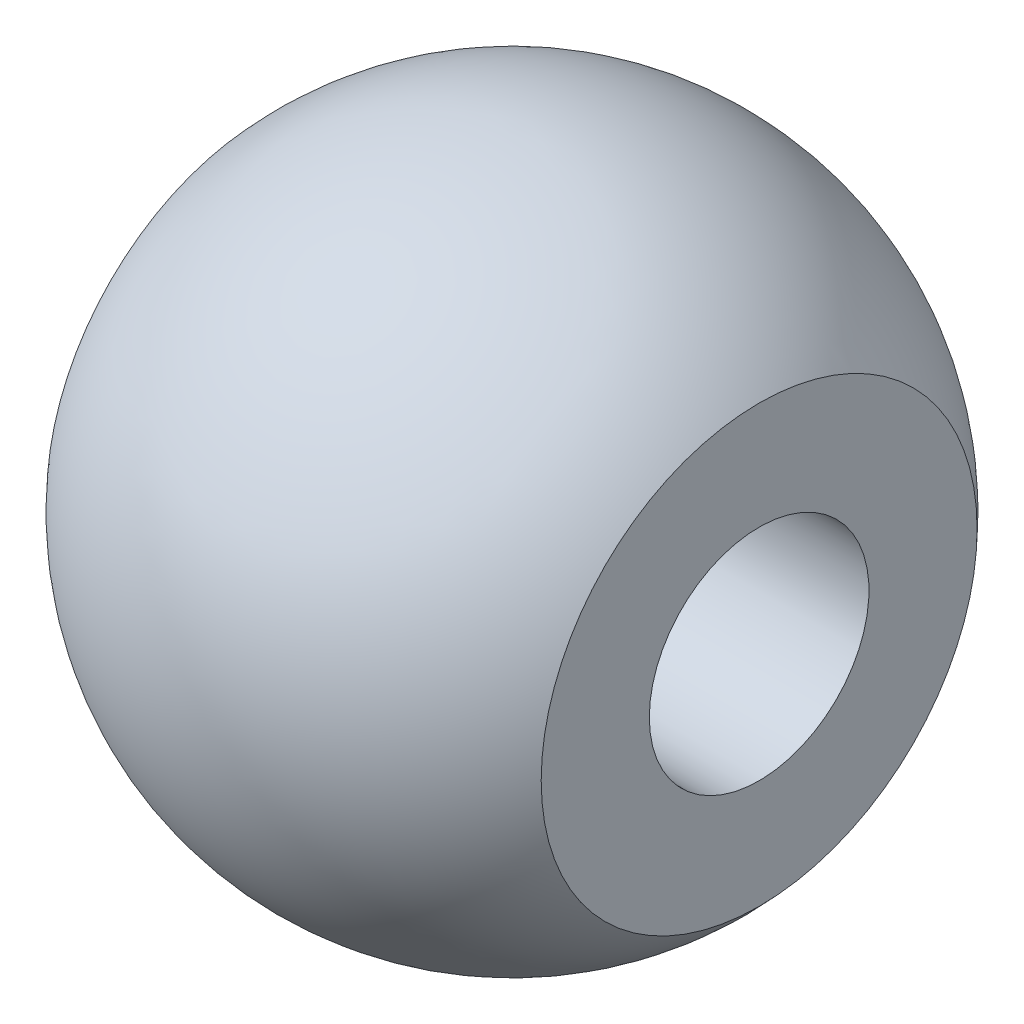
ISO-10303-21;
HEADER;
FILE_DESCRIPTION(('STEP AP214'),'2;1');
FILE_NAME('part.step','',(''),(''),'','','');
FILE_SCHEMA(('AUTOMOTIVE_DESIGN { 1 0 10303 214 1 1 1 1 }'));
ENDSEC;
DATA;
#1=APPLICATION_CONTEXT('core data for automotive mechanical design processes');
#2=APPLICATION_PROTOCOL_DEFINITION('international standard','automotive_design',2000,#1);
#3=PRODUCT_CONTEXT('',#1,'mechanical');
#4=PRODUCT('Part','Part','',(#3));
#5=PRODUCT_RELATED_PRODUCT_CATEGORY('part','',(#4));
#6=PRODUCT_DEFINITION_FORMATION('','',#4);
#7=PRODUCT_DEFINITION_CONTEXT('part definition',#1,'design');
#8=PRODUCT_DEFINITION('design','',#6,#7);
#9=PRODUCT_DEFINITION_SHAPE('','',#8);
#10=(LENGTH_UNIT() NAMED_UNIT(*) SI_UNIT(.MILLI.,.METRE.));
#11=(NAMED_UNIT(*) PLANE_ANGLE_UNIT() SI_UNIT($,.RADIAN.));
#12=(NAMED_UNIT(*) SI_UNIT($,.STERADIAN.) SOLID_ANGLE_UNIT());
#13=UNCERTAINTY_MEASURE_WITH_UNIT(LENGTH_MEASURE(1.E-05),#10,'distance_accuracy_value','');
#14=(GEOMETRIC_REPRESENTATION_CONTEXT(3) GLOBAL_UNCERTAINTY_ASSIGNED_CONTEXT((#13)) GLOBAL_UNIT_ASSIGNED_CONTEXT((#10,
#11,#12)) REPRESENTATION_CONTEXT('',''));
#15=CARTESIAN_POINT('',(0.,0.,0.));
#16=DIRECTION('',(0.,0.,1.));
#17=DIRECTION('',(1.,0.,0.));
#18=AXIS2_PLACEMENT_3D('',#15,#16,#17);
#19=CARTESIAN_POINT('',(0.,6.,0.));
#20=DIRECTION('',(0.,-1.,0.));
#21=DIRECTION('',(-1.,0.,0.));
#22=AXIS2_PLACEMENT_3D('',#19,#20,#21);
#23=SPHERICAL_SURFACE('',#22,6.);
#24=CARTESIAN_POINT('',(0.,6.,0.));
#25=DIRECTION('',(-1.,0.,0.));
#26=DIRECTION('',(0.,0.,1.));
#27=AXIS2_PLACEMENT_3D('',#24,#25,#26);
#28=SPHERICAL_SURFACE('',#27,6.);
#29=CARTESIAN_POINT('',(4.5,6.,0.));
#30=DIRECTION('',(-1.,0.,0.));
#31=DIRECTION('',(0.,0.,1.));
#32=AXIS2_PLACEMENT_3D('',#29,#30,#31);
#33=CIRCLE('',#32,3.96862696659689);
#34=CARTESIAN_POINT('',(4.5,6.,3.96862696659689));
#35=VERTEX_POINT('',#34);
#36=EDGE_CURVE('E40',#35,#35,#33,.F.);
#37=ORIENTED_EDGE('',*,*,#36,.F.);
#38=EDGE_LOOP('',(#37));
#39=FACE_BOUND('',#38,.T.);
#40=CARTESIAN_POINT('',(-4.5,6.,0.));
#41=DIRECTION('',(-1.,0.,0.));
#42=DIRECTION('',(0.,0.,1.));
#43=AXIS2_PLACEMENT_3D('',#40,#41,#42);
#44=CIRCLE('',#43,3.96862696659689);
#45=CARTESIAN_POINT('',(-4.5,6.,3.96862696659689));
#46=VERTEX_POINT('',#45);
#47=EDGE_CURVE('E10',#46,#46,#44,.F.);
#48=ORIENTED_EDGE('',*,*,#47,.T.);
#49=EDGE_LOOP('',(#48));
#50=FACE_BOUND('',#49,.T.);
#51=ADVANCED_FACE('F33',(#39,#50),#28,.T.);
#52=CARTESIAN_POINT('',(-4.5,12.001,7.47734115992912));
#53=DIRECTION('',(-1.,0.,0.));
#54=DIRECTION('',(0.,0.,1.));
#55=AXIS2_PLACEMENT_3D('',#52,#53,#54);
#56=PLANE('',#55);
#57=CARTESIAN_POINT('',(-4.5,6.01212860985356,0.));
#58=DIRECTION('',(-1.,0.,0.));
#59=DIRECTION('',(0.,0.,1.));
#60=AXIS2_PLACEMENT_3D('',#57,#58,#59);
#61=CIRCLE('',#60,2.5);
#62=CARTESIAN_POINT('',(-4.5,6.01212860985356,2.5));
#63=VERTEX_POINT('',#62);
#64=EDGE_CURVE('E49',#63,#63,#61,.T.);
#65=ORIENTED_EDGE('',*,*,#64,.F.);
#66=EDGE_LOOP('',(#65));
#67=FACE_BOUND('',#66,.T.);
#68=ORIENTED_EDGE('',*,*,#47,.F.);
#69=EDGE_LOOP('',(#68));
#70=FACE_BOUND('',#69,.T.);
#71=ADVANCED_FACE('F55',(#67,#70),#56,.T.);
#72=CARTESIAN_POINT('',(4.5,12.001,7.47734115992912));
#73=DIRECTION('',(-1.,0.,0.));
#74=DIRECTION('',(0.,0.,1.));
#75=AXIS2_PLACEMENT_3D('',#72,#73,#74);
#76=PLANE('',#75);
#77=CARTESIAN_POINT('',(4.5,6.01212860985356,0.));
#78=DIRECTION('',(-1.,0.,0.));
#79=DIRECTION('',(0.,0.,1.));
#80=AXIS2_PLACEMENT_3D('',#77,#78,#79);
#81=CIRCLE('',#80,2.);
#82=CARTESIAN_POINT('',(4.5,6.01212860985356,2.));
#83=VERTEX_POINT('',#82);
#84=EDGE_CURVE('E36',#83,#83,#81,.T.);
#85=ORIENTED_EDGE('',*,*,#84,.T.);
#86=EDGE_LOOP('',(#85));
#87=FACE_BOUND('',#86,.T.);
#88=ORIENTED_EDGE('',*,*,#36,.T.);
#89=EDGE_LOOP('',(#88));
#90=FACE_BOUND('',#89,.T.);
#91=ADVANCED_FACE('F58',(#87,#90),#76,.F.);
#92=CARTESIAN_POINT('',(-4.5,6.01212860985356,0.));
#93=DIRECTION('',(-1.,0.,0.));
#94=DIRECTION('',(0.,0.,1.));
#95=AXIS2_PLACEMENT_3D('',#92,#93,#94);
#96=CYLINDRICAL_SURFACE('',#95,2.);
#97=CARTESIAN_POINT('',(-3.29289321881346,6.01212860985356,0.));
#98=DIRECTION('',(-1.,0.,0.));
#99=DIRECTION('',(0.,0.,1.));
#100=AXIS2_PLACEMENT_3D('',#97,#98,#99);
#101=CIRCLE('',#100,2.);
#102=CARTESIAN_POINT('',(-3.29289321881346,6.01212860985356,2.));
#103=VERTEX_POINT('',#102);
#104=EDGE_CURVE('E46',#103,#103,#101,.T.);
#105=ORIENTED_EDGE('',*,*,#104,.T.);
#106=EDGE_LOOP('',(#105));
#107=FACE_BOUND('',#106,.T.);
#108=ORIENTED_EDGE('',*,*,#84,.F.);
#109=EDGE_LOOP('',(#108));
#110=FACE_BOUND('',#109,.T.);
#111=ADVANCED_FACE('F63',(#107,#110),#96,.F.);
#112=CARTESIAN_POINT('',(-4.5,6.01212860985356,0.));
#113=DIRECTION('',(-1.,0.,0.));
#114=DIRECTION('',(0.,0.,1.));
#115=AXIS2_PLACEMENT_3D('',#112,#113,#114);
#116=CONICAL_SURFACE('',#115,2.5,0.392699081698724);
#117=ORIENTED_EDGE('',*,*,#104,.F.);
#118=EDGE_LOOP('',(#117));
#119=FACE_BOUND('',#118,.T.);
#120=ORIENTED_EDGE('',*,*,#64,.T.);
#121=EDGE_LOOP('',(#120));
#122=FACE_BOUND('',#121,.T.);
#123=ADVANCED_FACE('F53',(#119,#122),#116,.F.);
#124=CLOSED_SHELL('',(#51,#71,#91,#111,#123));
#125=MANIFOLD_SOLID_BREP('B2',#124);
#126=ADVANCED_BREP_SHAPE_REPRESENTATION('',(#18,#125),#14);
#127=SHAPE_DEFINITION_REPRESENTATION(#9,#126);
ENDSEC;
END-ISO-10303-21;
